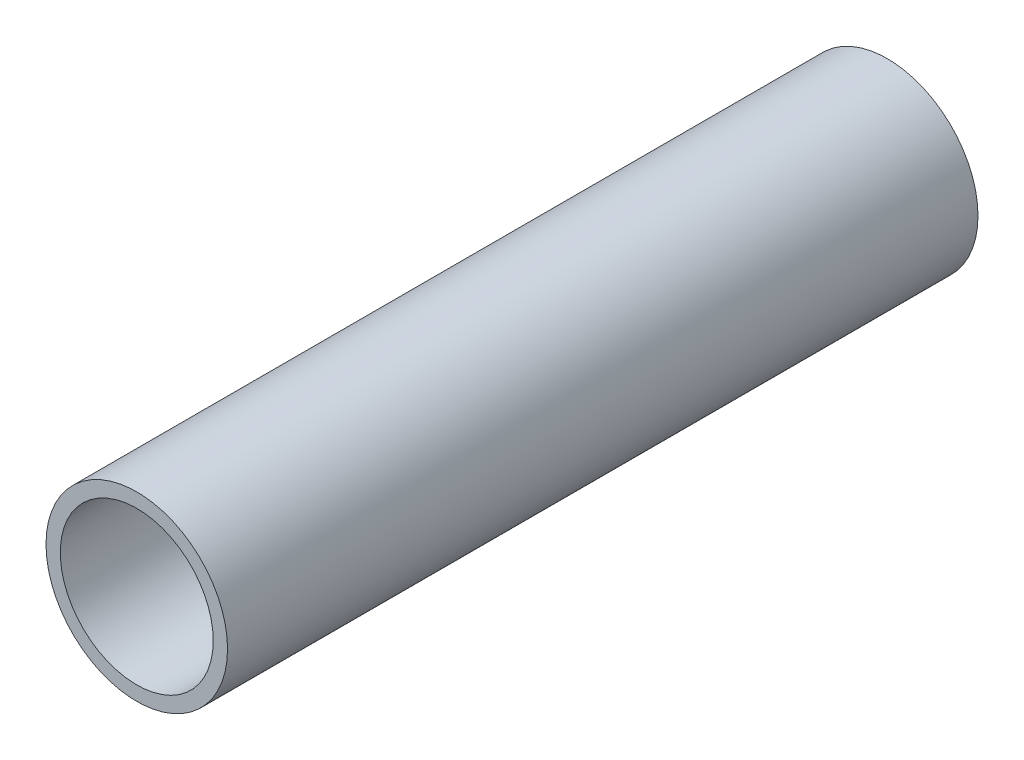
ISO-10303-21;
HEADER;
FILE_DESCRIPTION(('STEP AP214'),'2;1');
FILE_NAME('part.step','',(''),(''),'','','');
FILE_SCHEMA(('AUTOMOTIVE_DESIGN { 1 0 10303 214 1 1 1 1 }'));
ENDSEC;
DATA;
#1=APPLICATION_CONTEXT('core data for automotive mechanical design processes');
#2=APPLICATION_PROTOCOL_DEFINITION('international standard','automotive_design',2000,#1);
#3=PRODUCT_CONTEXT('',#1,'mechanical');
#4=PRODUCT('Part','Part','',(#3));
#5=PRODUCT_RELATED_PRODUCT_CATEGORY('part','',(#4));
#6=PRODUCT_DEFINITION_FORMATION('','',#4);
#7=PRODUCT_DEFINITION_CONTEXT('part definition',#1,'design');
#8=PRODUCT_DEFINITION('design','',#6,#7);
#9=PRODUCT_DEFINITION_SHAPE('','',#8);
#10=(LENGTH_UNIT() NAMED_UNIT(*) SI_UNIT(.MILLI.,.METRE.));
#11=(NAMED_UNIT(*) PLANE_ANGLE_UNIT() SI_UNIT($,.RADIAN.));
#12=(NAMED_UNIT(*) SI_UNIT($,.STERADIAN.) SOLID_ANGLE_UNIT());
#13=UNCERTAINTY_MEASURE_WITH_UNIT(LENGTH_MEASURE(1.E-05),#10,'distance_accuracy_value','');
#14=(GEOMETRIC_REPRESENTATION_CONTEXT(3) GLOBAL_UNCERTAINTY_ASSIGNED_CONTEXT((#13)) GLOBAL_UNIT_ASSIGNED_CONTEXT((#10,
#11,#12)) REPRESENTATION_CONTEXT('',''));
#15=CARTESIAN_POINT('',(0.,0.,0.));
#16=DIRECTION('',(0.,0.,1.));
#17=DIRECTION('',(1.,0.,0.));
#18=AXIS2_PLACEMENT_3D('',#15,#16,#17);
#19=CARTESIAN_POINT('',(0.,0.,105.));
#20=DIRECTION('',(0.,0.,1.));
#21=DIRECTION('',(1.,0.,0.));
#22=AXIS2_PLACEMENT_3D('',#19,#20,#21);
#23=PLANE('',#22);
#24=CARTESIAN_POINT('',(0.,0.,105.));
#25=DIRECTION('',(0.,0.,1.));
#26=DIRECTION('',(1.,0.,0.));
#27=AXIS2_PLACEMENT_3D('',#24,#25,#26);
#28=CIRCLE('',#27,12.7);
#29=CARTESIAN_POINT('',(12.7,0.,105.));
#30=VERTEX_POINT('',#29);
#31=EDGE_CURVE('E10',#30,#30,#28,.T.);
#32=ORIENTED_EDGE('',*,*,#31,.T.);
#33=EDGE_LOOP('',(#32));
#34=FACE_BOUND('',#33,.T.);
#35=CARTESIAN_POINT('',(0.,0.,105.));
#36=DIRECTION('',(0.,0.,1.));
#37=DIRECTION('',(1.,0.,0.));
#38=AXIS2_PLACEMENT_3D('',#35,#36,#37);
#39=CIRCLE('',#38,10.7);
#40=CARTESIAN_POINT('',(10.7,0.,105.));
#41=VERTEX_POINT('',#40);
#42=EDGE_CURVE('E43',#41,#41,#39,.T.);
#43=ORIENTED_EDGE('',*,*,#42,.F.);
#44=EDGE_LOOP('',(#43));
#45=FACE_BOUND('',#44,.T.);
#46=ADVANCED_FACE('F32',(#34,#45),#23,.T.);
#47=CARTESIAN_POINT('',(0.,0.,0.));
#48=DIRECTION('',(0.,0.,1.));
#49=DIRECTION('',(1.,0.,0.));
#50=AXIS2_PLACEMENT_3D('',#47,#48,#49);
#51=PLANE('',#50);
#52=CARTESIAN_POINT('',(0.,0.,0.));
#53=DIRECTION('',(0.,0.,1.));
#54=DIRECTION('',(1.,0.,0.));
#55=AXIS2_PLACEMENT_3D('',#52,#53,#54);
#56=CIRCLE('',#55,12.7);
#57=CARTESIAN_POINT('',(12.7,0.,0.));
#58=VERTEX_POINT('',#57);
#59=EDGE_CURVE('E36',#58,#58,#56,.T.);
#60=ORIENTED_EDGE('',*,*,#59,.F.);
#61=EDGE_LOOP('',(#60));
#62=FACE_BOUND('',#61,.T.);
#63=CARTESIAN_POINT('',(0.,0.,0.));
#64=DIRECTION('',(0.,0.,1.));
#65=DIRECTION('',(1.,0.,0.));
#66=AXIS2_PLACEMENT_3D('',#63,#64,#65);
#67=CIRCLE('',#66,10.7);
#68=CARTESIAN_POINT('',(10.7,0.,0.));
#69=VERTEX_POINT('',#68);
#70=EDGE_CURVE('E45',#69,#69,#67,.T.);
#71=ORIENTED_EDGE('',*,*,#70,.T.);
#72=EDGE_LOOP('',(#71));
#73=FACE_BOUND('',#72,.T.);
#74=ADVANCED_FACE('F55',(#62,#73),#51,.F.);
#75=CARTESIAN_POINT('',(0.,0.,105.));
#76=DIRECTION('',(0.,0.,-1.));
#77=DIRECTION('',(-1.,0.,0.));
#78=AXIS2_PLACEMENT_3D('',#75,#76,#77);
#79=CYLINDRICAL_SURFACE('',#78,12.7);
#80=ORIENTED_EDGE('',*,*,#31,.F.);
#81=EDGE_LOOP('',(#80));
#82=FACE_BOUND('',#81,.T.);
#83=ORIENTED_EDGE('',*,*,#59,.T.);
#84=EDGE_LOOP('',(#83));
#85=FACE_BOUND('',#84,.T.);
#86=ADVANCED_FACE('F34',(#82,#85),#79,.T.);
#87=CARTESIAN_POINT('',(0.,0.,105.));
#88=DIRECTION('',(0.,0.,-1.));
#89=DIRECTION('',(-1.,0.,0.));
#90=AXIS2_PLACEMENT_3D('',#87,#88,#89);
#91=CYLINDRICAL_SURFACE('',#90,10.7);
#92=ORIENTED_EDGE('',*,*,#42,.T.);
#93=EDGE_LOOP('',(#92));
#94=FACE_BOUND('',#93,.T.);
#95=ORIENTED_EDGE('',*,*,#70,.F.);
#96=EDGE_LOOP('',(#95));
#97=FACE_BOUND('',#96,.T.);
#98=ADVANCED_FACE('F51',(#94,#97),#91,.F.);
#99=CLOSED_SHELL('',(#46,#74,#86,#98));
#100=MANIFOLD_SOLID_BREP('B2',#99);
#101=ADVANCED_BREP_SHAPE_REPRESENTATION('',(#18,#100),#14);
#102=SHAPE_DEFINITION_REPRESENTATION(#9,#101);
ENDSEC;
END-ISO-10303-21;
